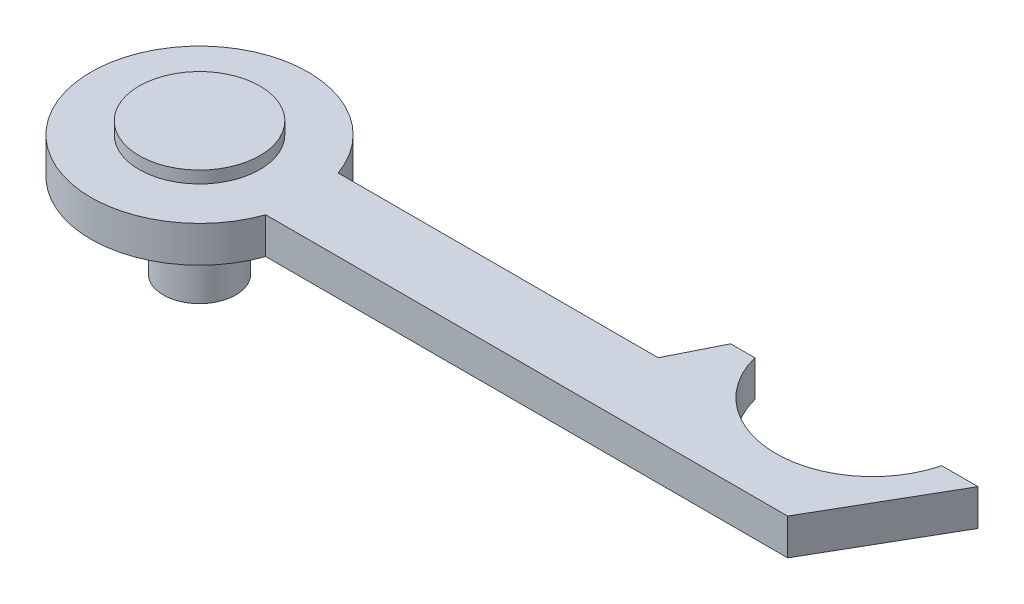
ISO-10303-21;
HEADER;
FILE_DESCRIPTION(('STEP AP214'),'2;1');
FILE_NAME('part.step','',(''),(''),'','','');
FILE_SCHEMA(('AUTOMOTIVE_DESIGN { 1 0 10303 214 1 1 1 1 }'));
ENDSEC;
DATA;
#1=APPLICATION_CONTEXT('core data for automotive mechanical design processes');
#2=APPLICATION_PROTOCOL_DEFINITION('international standard','automotive_design',2000,#1);
#3=PRODUCT_CONTEXT('',#1,'mechanical');
#4=PRODUCT('Part','Part','',(#3));
#5=PRODUCT_RELATED_PRODUCT_CATEGORY('part','',(#4));
#6=PRODUCT_DEFINITION_FORMATION('','',#4);
#7=PRODUCT_DEFINITION_CONTEXT('part definition',#1,'design');
#8=PRODUCT_DEFINITION('design','',#6,#7);
#9=PRODUCT_DEFINITION_SHAPE('','',#8);
#10=(LENGTH_UNIT() NAMED_UNIT(*) SI_UNIT(.MILLI.,.METRE.));
#11=(NAMED_UNIT(*) PLANE_ANGLE_UNIT() SI_UNIT($,.RADIAN.));
#12=(NAMED_UNIT(*) SI_UNIT($,.STERADIAN.) SOLID_ANGLE_UNIT());
#13=UNCERTAINTY_MEASURE_WITH_UNIT(LENGTH_MEASURE(1.E-05),#10,'distance_accuracy_value','');
#14=(GEOMETRIC_REPRESENTATION_CONTEXT(3) GLOBAL_UNCERTAINTY_ASSIGNED_CONTEXT((#13)) GLOBAL_UNIT_ASSIGNED_CONTEXT((#10,
#11,#12)) REPRESENTATION_CONTEXT('',''));
#15=CARTESIAN_POINT('',(0.,0.,0.));
#16=DIRECTION('',(0.,0.,1.));
#17=DIRECTION('',(1.,0.,0.));
#18=AXIS2_PLACEMENT_3D('',#15,#16,#17);
#19=CARTESIAN_POINT('',(0.,4.,0.));
#20=DIRECTION('',(0.,-1.,0.));
#21=DIRECTION('',(1.,0.,0.));
#22=AXIS2_PLACEMENT_3D('',#19,#20,#21);
#23=PLANE('',#22);
#24=CARTESIAN_POINT('',(0.,4.,0.));
#25=DIRECTION('',(0.,1.,0.));
#26=DIRECTION('',(-1.,0.,0.));
#27=AXIS2_PLACEMENT_3D('',#24,#25,#26);
#28=CIRCLE('',#27,5.);
#29=CARTESIAN_POINT('',(-5.,4.,0.));
#30=VERTEX_POINT('',#29);
#31=EDGE_CURVE('E11',#30,#30,#28,.T.);
#32=ORIENTED_EDGE('',*,*,#31,.T.);
#33=EDGE_LOOP('',(#32));
#34=FACE_BOUND('',#33,.T.);
#35=ADVANCED_FACE('F42',(#34),#23,.F.);
#36=CARTESIAN_POINT('',(0.,3.,0.));
#37=DIRECTION('',(0.,1.,0.));
#38=DIRECTION('',(-1.,0.,0.));
#39=AXIS2_PLACEMENT_3D('',#36,#37,#38);
#40=CYLINDRICAL_SURFACE('',#39,5.);
#41=ORIENTED_EDGE('',*,*,#31,.F.);
#42=EDGE_LOOP('',(#41));
#43=FACE_BOUND('',#42,.T.);
#44=CARTESIAN_POINT('',(0.,3.,0.));
#45=DIRECTION('',(0.,1.,0.));
#46=DIRECTION('',(-1.,0.,0.));
#47=AXIS2_PLACEMENT_3D('',#44,#45,#46);
#48=CIRCLE('',#47,5.);
#49=CARTESIAN_POINT('',(-5.,3.,0.));
#50=VERTEX_POINT('',#49);
#51=EDGE_CURVE('E48',#50,#50,#48,.T.);
#52=ORIENTED_EDGE('',*,*,#51,.T.);
#53=EDGE_LOOP('',(#52));
#54=FACE_BOUND('',#53,.T.);
#55=ADVANCED_FACE('F74',(#43,#54),#40,.T.);
#56=CARTESIAN_POINT('',(5.,3.,0.));
#57=DIRECTION('',(0.,1.,0.));
#58=DIRECTION('',(-1.,0.,0.));
#59=AXIS2_PLACEMENT_3D('',#56,#57,#58);
#60=PLANE('',#59);
#61=ORIENTED_EDGE('',*,*,#51,.F.);
#62=EDGE_LOOP('',(#61));
#63=FACE_BOUND('',#62,.T.);
#64=CARTESIAN_POINT('',(0.,3.,0.));
#65=DIRECTION('',(0.,1.,0.));
#66=DIRECTION('',(-1.,0.,0.));
#67=AXIS2_PLACEMENT_3D('',#64,#65,#66);
#68=CIRCLE('',#67,3.);
#69=CARTESIAN_POINT('',(-3.,3.,0.));
#70=VERTEX_POINT('',#69);
#71=EDGE_CURVE('E52',#70,#70,#68,.T.);
#72=ORIENTED_EDGE('',*,*,#71,.T.);
#73=EDGE_LOOP('',(#72));
#74=FACE_BOUND('',#73,.T.);
#75=ADVANCED_FACE('F70',(#63,#74),#60,.F.);
#76=CARTESIAN_POINT('',(0.,3.,0.));
#77=DIRECTION('',(0.,1.,0.));
#78=DIRECTION('',(-1.,0.,0.));
#79=AXIS2_PLACEMENT_3D('',#76,#77,#78);
#80=CYLINDRICAL_SURFACE('',#79,3.);
#81=ORIENTED_EDGE('',*,*,#71,.F.);
#82=EDGE_LOOP('',(#81));
#83=FACE_BOUND('',#82,.T.);
#84=CARTESIAN_POINT('',(0.,-7.,0.));
#85=DIRECTION('',(0.,1.,0.));
#86=DIRECTION('',(-1.,0.,0.));
#87=AXIS2_PLACEMENT_3D('',#84,#85,#86);
#88=CIRCLE('',#87,3.);
#89=CARTESIAN_POINT('',(-3.,-7.,0.));
#90=VERTEX_POINT('',#89);
#91=EDGE_CURVE('E56',#90,#90,#88,.T.);
#92=ORIENTED_EDGE('',*,*,#91,.T.);
#93=EDGE_LOOP('',(#92));
#94=FACE_BOUND('',#93,.T.);
#95=ADVANCED_FACE('F62',(#83,#94),#80,.T.);
#96=CARTESIAN_POINT('',(3.,-7.,0.));
#97=DIRECTION('',(0.,1.,0.));
#98=DIRECTION('',(-1.,0.,0.));
#99=AXIS2_PLACEMENT_3D('',#96,#97,#98);
#100=PLANE('',#99);
#101=ORIENTED_EDGE('',*,*,#91,.F.);
#102=EDGE_LOOP('',(#101));
#103=FACE_BOUND('',#102,.T.);
#104=ADVANCED_FACE('F64',(#103),#100,.F.);
#105=CLOSED_SHELL('',(#35,#55,#75,#95,#104));
#106=MANIFOLD_SOLID_BREP('B2',#105);
#107=CARTESIAN_POINT('',(0.,3.,0.));
#108=DIRECTION('',(0.,1.,0.));
#109=DIRECTION('',(0.,0.,1.));
#110=AXIS2_PLACEMENT_3D('',#107,#108,#109);
#111=PLANE('',#110);
#112=CARTESIAN_POINT('',(0.,3.,0.));
#113=DIRECTION('',(0.,1.,0.));
#114=DIRECTION('',(0.,0.,1.));
#115=AXIS2_PLACEMENT_3D('',#112,#113,#114);
#116=CIRCLE('',#115,9.);
#117=CARTESIAN_POINT('',(8.48528137423857,3.,-3.));
#118=VERTEX_POINT('',#117);
#119=CARTESIAN_POINT('',(8.48528137423857,3.,3.));
#120=VERTEX_POINT('',#119);
#121=EDGE_CURVE('E40',#118,#120,#116,.T.);
#122=ORIENTED_EDGE('',*,*,#121,.T.);
#123=DIRECTION('',(1.,0.,0.));
#124=VECTOR('',#123,1.);
#125=CARTESIAN_POINT('',(51.7184306929335,3.,3.));
#126=LINE('',#125,#124);
#127=CARTESIAN_POINT('',(51.7184306929335,3.,3.));
#128=VERTEX_POINT('',#127);
#129=EDGE_CURVE('E212',#120,#128,#126,.T.);
#130=ORIENTED_EDGE('',*,*,#129,.T.);
#131=DIRECTION('',(0.499999999999998,0.,-0.86602540378444));
#132=VECTOR('',#131,1.);
#133=CARTESIAN_POINT('',(57.4919333848297,3.,-7.));
#134=LINE('',#133,#132);
#135=CARTESIAN_POINT('',(57.4919333848297,3.,-7.));
#136=VERTEX_POINT('',#135);
#137=EDGE_CURVE('E215',#128,#136,#134,.T.);
#138=ORIENTED_EDGE('',*,*,#137,.T.);
#139=DIRECTION('',(-1.,0.,0.));
#140=VECTOR('',#139,1.);
#141=CARTESIAN_POINT('',(54.4919333848297,3.,-7.));
#142=LINE('',#141,#140);
#143=CARTESIAN_POINT('',(54.4919333848297,3.,-7.));
#144=VERTEX_POINT('',#143);
#145=EDGE_CURVE('E218',#136,#144,#142,.T.);
#146=ORIENTED_EDGE('',*,*,#145,.T.);
#147=CARTESIAN_POINT('',(46.7459666924148,3.,-9.));
#148=DIRECTION('',(0.,-1.,0.));
#149=DIRECTION('',(0.,0.,1.));
#150=AXIS2_PLACEMENT_3D('',#147,#148,#149);
#151=CIRCLE('',#150,8.);
#152=CARTESIAN_POINT('',(39.,3.,-7.));
#153=VERTEX_POINT('',#152);
#154=EDGE_CURVE('E221',#144,#153,#151,.T.);
#155=ORIENTED_EDGE('',*,*,#154,.T.);
#156=DIRECTION('',(-1.,0.,0.));
#157=VECTOR('',#156,1.);
#158=CARTESIAN_POINT('',(37.,3.,-7.));
#159=LINE('',#158,#157);
#160=CARTESIAN_POINT('',(37.,3.,-7.));
#161=VERTEX_POINT('',#160);
#162=EDGE_CURVE('E224',#153,#161,#159,.T.);
#163=ORIENTED_EDGE('',*,*,#162,.T.);
#164=DIRECTION('',(-0.447213595499958,0.,0.894427190999916));
#165=VECTOR('',#164,1.);
#166=CARTESIAN_POINT('',(35.,3.,-3.));
#167=LINE('',#166,#165);
#168=CARTESIAN_POINT('',(35.,3.,-3.));
#169=VERTEX_POINT('',#168);
#170=EDGE_CURVE('E188',#161,#169,#167,.T.);
#171=ORIENTED_EDGE('',*,*,#170,.T.);
#172=DIRECTION('',(-1.,0.,0.));
#173=VECTOR('',#172,1.);
#174=CARTESIAN_POINT('',(8.48528137423857,3.,-3.));
#175=LINE('',#174,#173);
#176=EDGE_CURVE('E126',#169,#118,#175,.T.);
#177=ORIENTED_EDGE('',*,*,#176,.T.);
#178=EDGE_LOOP('',(#122,#130,#138,#146,#155,#163,#171,#177));
#179=FACE_BOUND('',#178,.T.);
#180=CARTESIAN_POINT('',(0.,3.,0.));
#181=DIRECTION('',(0.,1.,0.));
#182=DIRECTION('',(0.,0.,1.));
#183=AXIS2_PLACEMENT_3D('',#180,#181,#182);
#184=CIRCLE('',#183,3.);
#185=CARTESIAN_POINT('',(0.,3.,3.));
#186=VERTEX_POINT('',#185);
#187=EDGE_CURVE('E241',#186,#186,#184,.T.);
#188=ORIENTED_EDGE('',*,*,#187,.F.);
#189=EDGE_LOOP('',(#188));
#190=FACE_BOUND('',#189,.T.);
#191=ADVANCED_FACE('F112',(#179,#190),#111,.T.);
#192=CARTESIAN_POINT('',(0.,0.,0.));
#193=DIRECTION('',(0.,1.,0.));
#194=DIRECTION('',(0.,0.,1.));
#195=AXIS2_PLACEMENT_3D('',#192,#193,#194);
#196=PLANE('',#195);
#197=CARTESIAN_POINT('',(0.,0.,0.));
#198=DIRECTION('',(0.,1.,0.));
#199=DIRECTION('',(0.,0.,1.));
#200=AXIS2_PLACEMENT_3D('',#197,#198,#199);
#201=CIRCLE('',#200,9.);
#202=CARTESIAN_POINT('',(8.48528137423857,0.,-3.));
#203=VERTEX_POINT('',#202);
#204=CARTESIAN_POINT('',(8.48528137423857,0.,3.));
#205=VERTEX_POINT('',#204);
#206=EDGE_CURVE('E116',#203,#205,#201,.T.);
#207=ORIENTED_EDGE('',*,*,#206,.F.);
#208=DIRECTION('',(-1.,0.,0.));
#209=VECTOR('',#208,1.);
#210=CARTESIAN_POINT('',(8.48528137423857,0.,-3.));
#211=LINE('',#210,#209);
#212=CARTESIAN_POINT('',(35.,0.,-3.));
#213=VERTEX_POINT('',#212);
#214=EDGE_CURVE('E134',#213,#203,#211,.T.);
#215=ORIENTED_EDGE('',*,*,#214,.F.);
#216=DIRECTION('',(-0.447213595499958,0.,0.894427190999916));
#217=VECTOR('',#216,1.);
#218=CARTESIAN_POINT('',(35.,0.,-3.));
#219=LINE('',#218,#217);
#220=CARTESIAN_POINT('',(37.,0.,-7.));
#221=VERTEX_POINT('',#220);
#222=EDGE_CURVE('E187',#221,#213,#219,.T.);
#223=ORIENTED_EDGE('',*,*,#222,.F.);
#224=DIRECTION('',(-1.,0.,0.));
#225=VECTOR('',#224,1.);
#226=CARTESIAN_POINT('',(37.,0.,-7.));
#227=LINE('',#226,#225);
#228=CARTESIAN_POINT('',(39.,0.,-7.));
#229=VERTEX_POINT('',#228);
#230=EDGE_CURVE('E201',#229,#221,#227,.T.);
#231=ORIENTED_EDGE('',*,*,#230,.F.);
#232=CARTESIAN_POINT('',(46.7459666924148,0.,-9.));
#233=DIRECTION('',(0.,-1.,0.));
#234=DIRECTION('',(0.,0.,1.));
#235=AXIS2_PLACEMENT_3D('',#232,#233,#234);
#236=CIRCLE('',#235,8.);
#237=CARTESIAN_POINT('',(54.4919333848297,0.,-7.));
#238=VERTEX_POINT('',#237);
#239=EDGE_CURVE('E205',#238,#229,#236,.T.);
#240=ORIENTED_EDGE('',*,*,#239,.F.);
#241=DIRECTION('',(-1.,0.,0.));
#242=VECTOR('',#241,1.);
#243=CARTESIAN_POINT('',(54.4919333848297,0.,-7.));
#244=LINE('',#243,#242);
#245=CARTESIAN_POINT('',(57.4919333848297,0.,-7.));
#246=VERTEX_POINT('',#245);
#247=EDGE_CURVE('E207',#246,#238,#244,.T.);
#248=ORIENTED_EDGE('',*,*,#247,.F.);
#249=DIRECTION('',(0.499999999999998,0.,-0.86602540378444));
#250=VECTOR('',#249,1.);
#251=CARTESIAN_POINT('',(57.4919333848297,0.,-7.));
#252=LINE('',#251,#250);
#253=CARTESIAN_POINT('',(51.7184306929335,0.,3.));
#254=VERTEX_POINT('',#253);
#255=EDGE_CURVE('E271',#254,#246,#252,.T.);
#256=ORIENTED_EDGE('',*,*,#255,.F.);
#257=DIRECTION('',(1.,0.,0.));
#258=VECTOR('',#257,1.);
#259=CARTESIAN_POINT('',(51.7184306929335,0.,3.));
#260=LINE('',#259,#258);
#261=EDGE_CURVE('E228',#205,#254,#260,.T.);
#262=ORIENTED_EDGE('',*,*,#261,.F.);
#263=EDGE_LOOP('',(#207,#215,#223,#231,#240,#248,#256,#262));
#264=FACE_BOUND('',#263,.T.);
#265=CARTESIAN_POINT('',(0.,0.,0.));
#266=DIRECTION('',(0.,1.,0.));
#267=DIRECTION('',(0.,0.,1.));
#268=AXIS2_PLACEMENT_3D('',#265,#266,#267);
#269=CIRCLE('',#268,3.);
#270=CARTESIAN_POINT('',(0.,0.,3.));
#271=VERTEX_POINT('',#270);
#272=EDGE_CURVE('E231',#271,#271,#269,.T.);
#273=ORIENTED_EDGE('',*,*,#272,.T.);
#274=EDGE_LOOP('',(#273));
#275=FACE_BOUND('',#274,.T.);
#276=ADVANCED_FACE('F198',(#264,#275),#196,.F.);
#277=CARTESIAN_POINT('',(0.,3.,0.));
#278=DIRECTION('',(0.,-1.,0.));
#279=DIRECTION('',(0.,0.,-1.));
#280=AXIS2_PLACEMENT_3D('',#277,#278,#279);
#281=CYLINDRICAL_SURFACE('',#280,9.);
#282=ORIENTED_EDGE('',*,*,#121,.F.);
#283=DIRECTION('',(0.,1.,0.));
#284=VECTOR('',#283,1.);
#285=CARTESIAN_POINT('',(8.48528137423857,0.,-3.));
#286=LINE('',#285,#284);
#287=EDGE_CURVE('E229',#203,#118,#286,.T.);
#288=ORIENTED_EDGE('',*,*,#287,.F.);
#289=ORIENTED_EDGE('',*,*,#206,.T.);
#290=DIRECTION('',(0.,1.,0.));
#291=VECTOR('',#290,1.);
#292=CARTESIAN_POINT('',(8.48528137423857,0.,3.));
#293=LINE('',#292,#291);
#294=EDGE_CURVE('E170',#205,#120,#293,.T.);
#295=ORIENTED_EDGE('',*,*,#294,.T.);
#296=EDGE_LOOP('',(#282,#288,#289,#295));
#297=FACE_BOUND('',#296,.T.);
#298=ADVANCED_FACE('F114',(#297),#281,.T.);
#299=CARTESIAN_POINT('',(0.,3.,0.));
#300=DIRECTION('',(0.,-1.,0.));
#301=DIRECTION('',(0.,0.,-1.));
#302=AXIS2_PLACEMENT_3D('',#299,#300,#301);
#303=CYLINDRICAL_SURFACE('',#302,3.);
#304=ORIENTED_EDGE('',*,*,#187,.T.);
#305=EDGE_LOOP('',(#304));
#306=FACE_BOUND('',#305,.T.);
#307=ORIENTED_EDGE('',*,*,#272,.F.);
#308=EDGE_LOOP('',(#307));
#309=FACE_BOUND('',#308,.T.);
#310=ADVANCED_FACE('F247',(#306,#309),#303,.F.);
#311=CARTESIAN_POINT('',(8.48528137423857,0.,-3.));
#312=DIRECTION('',(0.,0.,-1.));
#313=DIRECTION('',(-1.,0.,0.));
#314=AXIS2_PLACEMENT_3D('',#311,#312,#313);
#315=PLANE('',#314);
#316=ORIENTED_EDGE('',*,*,#176,.F.);
#317=DIRECTION('',(0.,1.,0.));
#318=VECTOR('',#317,1.);
#319=CARTESIAN_POINT('',(35.,0.,-3.));
#320=LINE('',#319,#318);
#321=EDGE_CURVE('E163',#213,#169,#320,.T.);
#322=ORIENTED_EDGE('',*,*,#321,.F.);
#323=ORIENTED_EDGE('',*,*,#214,.T.);
#324=ORIENTED_EDGE('',*,*,#287,.T.);
#325=EDGE_LOOP('',(#316,#322,#323,#324));
#326=FACE_BOUND('',#325,.T.);
#327=ADVANCED_FACE('F249',(#326),#315,.T.);
#328=CARTESIAN_POINT('',(35.,0.,-3.));
#329=DIRECTION('',(-0.894427190999916,0.,-0.447213595499958));
#330=DIRECTION('',(-0.447213595499958,0.,0.894427190999916));
#331=AXIS2_PLACEMENT_3D('',#328,#329,#330);
#332=PLANE('',#331);
#333=ORIENTED_EDGE('',*,*,#170,.F.);
#334=DIRECTION('',(0.,1.,0.));
#335=VECTOR('',#334,1.);
#336=CARTESIAN_POINT('',(37.,0.,-7.));
#337=LINE('',#336,#335);
#338=EDGE_CURVE('E184',#221,#161,#337,.T.);
#339=ORIENTED_EDGE('',*,*,#338,.F.);
#340=ORIENTED_EDGE('',*,*,#222,.T.);
#341=ORIENTED_EDGE('',*,*,#321,.T.);
#342=EDGE_LOOP('',(#333,#339,#340,#341));
#343=FACE_BOUND('',#342,.T.);
#344=ADVANCED_FACE('F186',(#343),#332,.T.);
#345=CARTESIAN_POINT('',(37.,0.,-7.));
#346=DIRECTION('',(0.,0.,-1.));
#347=DIRECTION('',(-1.,0.,0.));
#348=AXIS2_PLACEMENT_3D('',#345,#346,#347);
#349=PLANE('',#348);
#350=ORIENTED_EDGE('',*,*,#162,.F.);
#351=DIRECTION('',(0.,1.,0.));
#352=VECTOR('',#351,1.);
#353=CARTESIAN_POINT('',(39.,0.,-7.));
#354=LINE('',#353,#352);
#355=EDGE_CURVE('E193',#229,#153,#354,.T.);
#356=ORIENTED_EDGE('',*,*,#355,.F.);
#357=ORIENTED_EDGE('',*,*,#230,.T.);
#358=ORIENTED_EDGE('',*,*,#338,.T.);
#359=EDGE_LOOP('',(#350,#356,#357,#358));
#360=FACE_BOUND('',#359,.T.);
#361=ADVANCED_FACE('F204',(#360),#349,.T.);
#362=CARTESIAN_POINT('',(46.7459666924148,0.,-9.));
#363=DIRECTION('',(0.,1.,0.));
#364=DIRECTION('',(0.,0.,1.));
#365=AXIS2_PLACEMENT_3D('',#362,#363,#364);
#366=CYLINDRICAL_SURFACE('',#365,8.);
#367=ORIENTED_EDGE('',*,*,#154,.F.);
#368=DIRECTION('',(0.,1.,0.));
#369=VECTOR('',#368,1.);
#370=CARTESIAN_POINT('',(54.4919333848297,0.,-7.));
#371=LINE('',#370,#369);
#372=EDGE_CURVE('E234',#238,#144,#371,.T.);
#373=ORIENTED_EDGE('',*,*,#372,.F.);
#374=ORIENTED_EDGE('',*,*,#239,.T.);
#375=ORIENTED_EDGE('',*,*,#355,.T.);
#376=EDGE_LOOP('',(#367,#373,#374,#375));
#377=FACE_BOUND('',#376,.T.);
#378=ADVANCED_FACE('F291',(#377),#366,.F.);
#379=CARTESIAN_POINT('',(54.4919333848297,0.,-7.));
#380=DIRECTION('',(0.,0.,-1.));
#381=DIRECTION('',(-1.,0.,0.));
#382=AXIS2_PLACEMENT_3D('',#379,#380,#381);
#383=PLANE('',#382);
#384=ORIENTED_EDGE('',*,*,#145,.F.);
#385=DIRECTION('',(0.,1.,0.));
#386=VECTOR('',#385,1.);
#387=CARTESIAN_POINT('',(57.4919333848297,0.,-7.));
#388=LINE('',#387,#386);
#389=EDGE_CURVE('E236',#246,#136,#388,.T.);
#390=ORIENTED_EDGE('',*,*,#389,.F.);
#391=ORIENTED_EDGE('',*,*,#247,.T.);
#392=ORIENTED_EDGE('',*,*,#372,.T.);
#393=EDGE_LOOP('',(#384,#390,#391,#392));
#394=FACE_BOUND('',#393,.T.);
#395=ADVANCED_FACE('F277',(#394),#383,.T.);
#396=CARTESIAN_POINT('',(57.4919333848297,0.,-7.));
#397=DIRECTION('',(0.86602540378444,0.,0.499999999999998));
#398=DIRECTION('',(0.499999999999998,0.,-0.86602540378444));
#399=AXIS2_PLACEMENT_3D('',#396,#397,#398);
#400=PLANE('',#399);
#401=ORIENTED_EDGE('',*,*,#137,.F.);
#402=DIRECTION('',(0.,1.,0.));
#403=VECTOR('',#402,1.);
#404=CARTESIAN_POINT('',(51.7184306929335,0.,3.));
#405=LINE('',#404,#403);
#406=EDGE_CURVE('E238',#254,#128,#405,.T.);
#407=ORIENTED_EDGE('',*,*,#406,.F.);
#408=ORIENTED_EDGE('',*,*,#255,.T.);
#409=ORIENTED_EDGE('',*,*,#389,.T.);
#410=EDGE_LOOP('',(#401,#407,#408,#409));
#411=FACE_BOUND('',#410,.T.);
#412=ADVANCED_FACE('F281',(#411),#400,.T.);
#413=CARTESIAN_POINT('',(51.7184306929335,0.,3.));
#414=DIRECTION('',(0.,0.,1.));
#415=DIRECTION('',(1.,0.,0.));
#416=AXIS2_PLACEMENT_3D('',#413,#414,#415);
#417=PLANE('',#416);
#418=ORIENTED_EDGE('',*,*,#129,.F.);
#419=ORIENTED_EDGE('',*,*,#294,.F.);
#420=ORIENTED_EDGE('',*,*,#261,.T.);
#421=ORIENTED_EDGE('',*,*,#406,.T.);
#422=EDGE_LOOP('',(#418,#419,#420,#421));
#423=FACE_BOUND('',#422,.T.);
#424=ADVANCED_FACE('F282',(#423),#417,.T.);
#425=CLOSED_SHELL('',(#191,#276,#298,#310,#327,#344,#361,#378,#395,#412,#424));
#426=MANIFOLD_SOLID_BREP('B6',#425);
#427=ADVANCED_BREP_SHAPE_REPRESENTATION('',(#18,#106,#426),#14);
#428=SHAPE_DEFINITION_REPRESENTATION(#9,#427);
ENDSEC;
END-ISO-10303-21;
